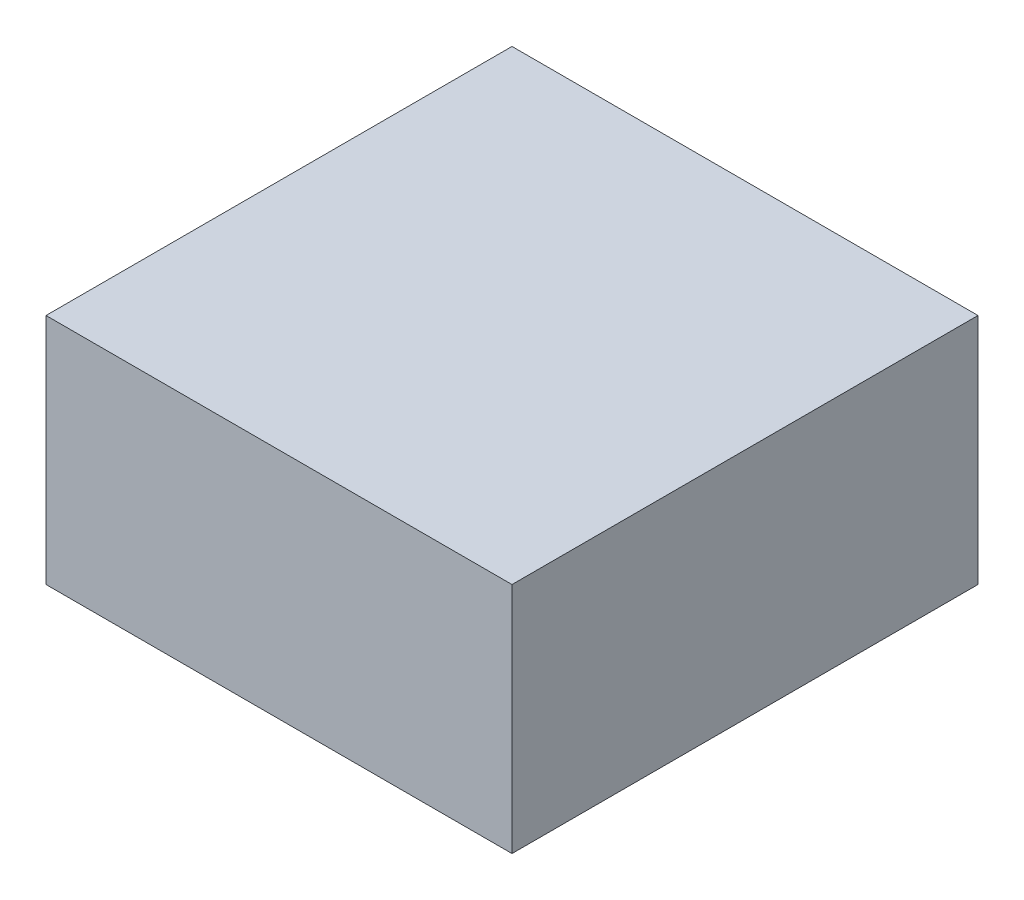
ISO-10303-21;
HEADER;
FILE_DESCRIPTION(('STEP AP214'),'2;1');
FILE_NAME('part.step','',(''),(''),'','','');
FILE_SCHEMA(('AUTOMOTIVE_DESIGN { 1 0 10303 214 1 1 1 1 }'));
ENDSEC;
DATA;
#1=APPLICATION_CONTEXT('core data for automotive mechanical design processes');
#2=APPLICATION_PROTOCOL_DEFINITION('international standard','automotive_design',2000,#1);
#3=PRODUCT_CONTEXT('',#1,'mechanical');
#4=PRODUCT('Part','Part','',(#3));
#5=PRODUCT_RELATED_PRODUCT_CATEGORY('part','',(#4));
#6=PRODUCT_DEFINITION_FORMATION('','',#4);
#7=PRODUCT_DEFINITION_CONTEXT('part definition',#1,'design');
#8=PRODUCT_DEFINITION('design','',#6,#7);
#9=PRODUCT_DEFINITION_SHAPE('','',#8);
#10=(LENGTH_UNIT() NAMED_UNIT(*) SI_UNIT(.MILLI.,.METRE.));
#11=(NAMED_UNIT(*) PLANE_ANGLE_UNIT() SI_UNIT($,.RADIAN.));
#12=(NAMED_UNIT(*) SI_UNIT($,.STERADIAN.) SOLID_ANGLE_UNIT());
#13=UNCERTAINTY_MEASURE_WITH_UNIT(LENGTH_MEASURE(1.E-05),#10,'distance_accuracy_value','');
#14=(GEOMETRIC_REPRESENTATION_CONTEXT(3) GLOBAL_UNCERTAINTY_ASSIGNED_CONTEXT((#13)) GLOBAL_UNIT_ASSIGNED_CONTEXT((#10,
#11,#12)) REPRESENTATION_CONTEXT('',''));
#15=CARTESIAN_POINT('',(0.,0.,0.));
#16=DIRECTION('',(0.,0.,1.));
#17=DIRECTION('',(1.,0.,0.));
#18=AXIS2_PLACEMENT_3D('',#15,#16,#17);
#19=CARTESIAN_POINT('',(-4.96729528504373,1.53266331658292,10.));
#20=DIRECTION('',(1.,0.,0.));
#21=DIRECTION('',(0.,1.,0.));
#22=AXIS2_PLACEMENT_3D('',#19,#20,#21);
#23=PLANE('',#22);
#24=DIRECTION('',(0.,-1.,0.));
#25=VECTOR('',#24,1.);
#26=CARTESIAN_POINT('',(-4.96729528504373,1.53266331658292,0.));
#27=LINE('',#26,#25);
#28=CARTESIAN_POINT('',(-4.96729528504373,1.53266331658292,0.));
#29=VERTEX_POINT('',#28);
#30=CARTESIAN_POINT('',(-4.96729528504373,-3.46733668341708,0.));
#31=VERTEX_POINT('',#30);
#32=EDGE_CURVE('E107',#29,#31,#27,.T.);
#33=ORIENTED_EDGE('',*,*,#32,.T.);
#34=DIRECTION('',(0.,0.,-1.));
#35=VECTOR('',#34,1.);
#36=CARTESIAN_POINT('',(-4.96729528504373,-3.46733668341708,10.));
#37=LINE('',#36,#35);
#38=CARTESIAN_POINT('',(-4.96729528504373,-3.46733668341708,10.));
#39=VERTEX_POINT('',#38);
#40=EDGE_CURVE('E11',#39,#31,#37,.T.);
#41=ORIENTED_EDGE('',*,*,#40,.F.);
#42=DIRECTION('',(0.,-1.,0.));
#43=VECTOR('',#42,1.);
#44=CARTESIAN_POINT('',(-4.96729528504373,1.53266331658292,10.));
#45=LINE('',#44,#43);
#46=CARTESIAN_POINT('',(-4.96729528504373,1.53266331658292,10.));
#47=VERTEX_POINT('',#46);
#48=EDGE_CURVE('E91',#47,#39,#45,.T.);
#49=ORIENTED_EDGE('',*,*,#48,.F.);
#50=DIRECTION('',(0.,0.,-1.));
#51=VECTOR('',#50,1.);
#52=CARTESIAN_POINT('',(-4.96729528504373,1.53266331658292,10.));
#53=LINE('',#52,#51);
#54=EDGE_CURVE('E103',#47,#29,#53,.T.);
#55=ORIENTED_EDGE('',*,*,#54,.T.);
#56=EDGE_LOOP('',(#33,#41,#49,#55));
#57=FACE_BOUND('',#56,.T.);
#58=ADVANCED_FACE('F39',(#57),#23,.F.);
#59=CARTESIAN_POINT('',(-4.96729528504373,-3.46733668341708,10.));
#60=DIRECTION('',(0.,1.,0.));
#61=DIRECTION('',(0.,0.,1.));
#62=AXIS2_PLACEMENT_3D('',#59,#60,#61);
#63=PLANE('',#62);
#64=DIRECTION('',(1.,0.,0.));
#65=VECTOR('',#64,1.);
#66=CARTESIAN_POINT('',(-4.96729528504373,-3.46733668341708,0.));
#67=LINE('',#66,#65);
#68=CARTESIAN_POINT('',(5.03270471495628,-3.46733668341708,0.));
#69=VERTEX_POINT('',#68);
#70=EDGE_CURVE('E96',#31,#69,#67,.T.);
#71=ORIENTED_EDGE('',*,*,#70,.T.);
#72=DIRECTION('',(0.,0.,-1.));
#73=VECTOR('',#72,1.);
#74=CARTESIAN_POINT('',(5.03270471495628,-3.46733668341708,10.));
#75=LINE('',#74,#73);
#76=CARTESIAN_POINT('',(5.03270471495628,-3.46733668341708,10.));
#77=VERTEX_POINT('',#76);
#78=EDGE_CURVE('E48',#77,#69,#75,.T.);
#79=ORIENTED_EDGE('',*,*,#78,.F.);
#80=DIRECTION('',(1.,0.,0.));
#81=VECTOR('',#80,1.);
#82=CARTESIAN_POINT('',(-4.96729528504373,-3.46733668341708,10.));
#83=LINE('',#82,#81);
#84=EDGE_CURVE('E86',#39,#77,#83,.T.);
#85=ORIENTED_EDGE('',*,*,#84,.F.);
#86=ORIENTED_EDGE('',*,*,#40,.T.);
#87=EDGE_LOOP('',(#71,#79,#85,#86));
#88=FACE_BOUND('',#87,.T.);
#89=ADVANCED_FACE('F95',(#88),#63,.F.);
#90=CARTESIAN_POINT('',(5.03270471495627,1.53266331658292,10.));
#91=DIRECTION('',(-1.,0.,0.));
#92=DIRECTION('',(0.,-1.,0.));
#93=AXIS2_PLACEMENT_3D('',#90,#91,#92);
#94=PLANE('',#93);
#95=DIRECTION('',(0.,1.,0.));
#96=VECTOR('',#95,1.);
#97=CARTESIAN_POINT('',(5.03270471495627,1.53266331658292,0.));
#98=LINE('',#97,#96);
#99=CARTESIAN_POINT('',(5.03270471495627,1.53266331658292,0.));
#100=VERTEX_POINT('',#99);
#101=EDGE_CURVE('E73',#69,#100,#98,.T.);
#102=ORIENTED_EDGE('',*,*,#101,.T.);
#103=DIRECTION('',(0.,0.,-1.));
#104=VECTOR('',#103,1.);
#105=CARTESIAN_POINT('',(5.03270471495627,1.53266331658292,10.));
#106=LINE('',#105,#104);
#107=CARTESIAN_POINT('',(5.03270471495627,1.53266331658292,10.));
#108=VERTEX_POINT('',#107);
#109=EDGE_CURVE('E98',#108,#100,#106,.T.);
#110=ORIENTED_EDGE('',*,*,#109,.F.);
#111=DIRECTION('',(0.,1.,0.));
#112=VECTOR('',#111,1.);
#113=CARTESIAN_POINT('',(5.03270471495627,1.53266331658292,10.));
#114=LINE('',#113,#112);
#115=EDGE_CURVE('E89',#77,#108,#114,.T.);
#116=ORIENTED_EDGE('',*,*,#115,.F.);
#117=ORIENTED_EDGE('',*,*,#78,.T.);
#118=EDGE_LOOP('',(#102,#110,#116,#117));
#119=FACE_BOUND('',#118,.T.);
#120=ADVANCED_FACE('F99',(#119),#94,.F.);
#121=CARTESIAN_POINT('',(-4.96729528504373,1.53266331658292,10.));
#122=DIRECTION('',(0.,-1.,0.));
#123=DIRECTION('',(0.,0.,-1.));
#124=AXIS2_PLACEMENT_3D('',#121,#122,#123);
#125=PLANE('',#124);
#126=DIRECTION('',(-1.,0.,0.));
#127=VECTOR('',#126,1.);
#128=CARTESIAN_POINT('',(-4.96729528504373,1.53266331658292,0.));
#129=LINE('',#128,#127);
#130=EDGE_CURVE('E79',#100,#29,#129,.T.);
#131=ORIENTED_EDGE('',*,*,#130,.T.);
#132=ORIENTED_EDGE('',*,*,#54,.F.);
#133=DIRECTION('',(-1.,0.,0.));
#134=VECTOR('',#133,1.);
#135=CARTESIAN_POINT('',(-4.96729528504373,1.53266331658292,10.));
#136=LINE('',#135,#134);
#137=EDGE_CURVE('E56',#108,#47,#136,.T.);
#138=ORIENTED_EDGE('',*,*,#137,.F.);
#139=ORIENTED_EDGE('',*,*,#109,.T.);
#140=EDGE_LOOP('',(#131,#132,#138,#139));
#141=FACE_BOUND('',#140,.T.);
#142=ADVANCED_FACE('F120',(#141),#125,.F.);
#143=CARTESIAN_POINT('',(0.,0.,10.));
#144=DIRECTION('',(0.,0.,1.));
#145=DIRECTION('',(1.,0.,0.));
#146=AXIS2_PLACEMENT_3D('',#143,#144,#145);
#147=PLANE('',#146);
#148=ORIENTED_EDGE('',*,*,#48,.T.);
#149=ORIENTED_EDGE('',*,*,#84,.T.);
#150=ORIENTED_EDGE('',*,*,#115,.T.);
#151=ORIENTED_EDGE('',*,*,#137,.T.);
#152=EDGE_LOOP('',(#148,#149,#150,#151));
#153=FACE_BOUND('',#152,.T.);
#154=ADVANCED_FACE('F87',(#153),#147,.T.);
#155=CARTESIAN_POINT('',(0.,0.,0.));
#156=DIRECTION('',(0.,0.,1.));
#157=DIRECTION('',(1.,0.,0.));
#158=AXIS2_PLACEMENT_3D('',#155,#156,#157);
#159=PLANE('',#158);
#160=ORIENTED_EDGE('',*,*,#32,.F.);
#161=ORIENTED_EDGE('',*,*,#130,.F.);
#162=ORIENTED_EDGE('',*,*,#101,.F.);
#163=ORIENTED_EDGE('',*,*,#70,.F.);
#164=EDGE_LOOP('',(#160,#161,#162,#163));
#165=FACE_BOUND('',#164,.T.);
#166=ADVANCED_FACE('F123',(#165),#159,.F.);
#167=CLOSED_SHELL('',(#58,#89,#120,#142,#154,#166));
#168=MANIFOLD_SOLID_BREP('B2',#167);
#169=ADVANCED_BREP_SHAPE_REPRESENTATION('',(#18,#168),#14);
#170=SHAPE_DEFINITION_REPRESENTATION(#9,#169);
ENDSEC;
END-ISO-10303-21;
